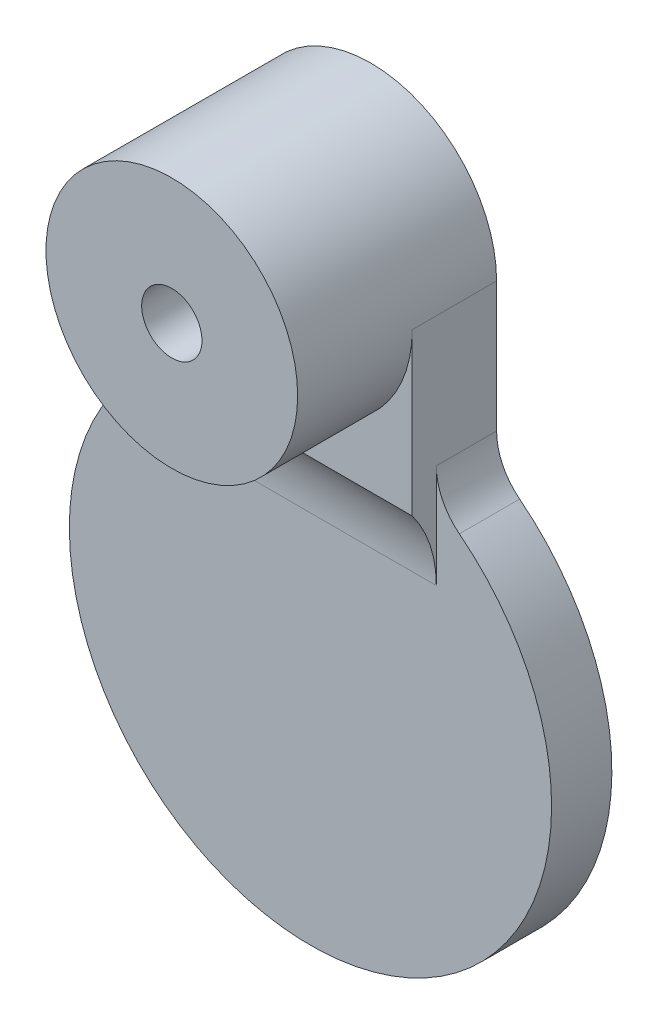
ISO-10303-21;
HEADER;
FILE_DESCRIPTION(('STEP AP214'),'2;1');
FILE_NAME('part.step','',(''),(''),'','','');
FILE_SCHEMA(('AUTOMOTIVE_DESIGN { 1 0 10303 214 1 1 1 1 }'));
ENDSEC;
DATA;
#1=APPLICATION_CONTEXT('core data for automotive mechanical design processes');
#2=APPLICATION_PROTOCOL_DEFINITION('international standard','automotive_design',2000,#1);
#3=PRODUCT_CONTEXT('',#1,'mechanical');
#4=PRODUCT('Part','Part','',(#3));
#5=PRODUCT_RELATED_PRODUCT_CATEGORY('part','',(#4));
#6=PRODUCT_DEFINITION_FORMATION('','',#4);
#7=PRODUCT_DEFINITION_CONTEXT('part definition',#1,'design');
#8=PRODUCT_DEFINITION('design','',#6,#7);
#9=PRODUCT_DEFINITION_SHAPE('','',#8);
#10=(LENGTH_UNIT() NAMED_UNIT(*) SI_UNIT(.MILLI.,.METRE.));
#11=(NAMED_UNIT(*) PLANE_ANGLE_UNIT() SI_UNIT($,.RADIAN.));
#12=(NAMED_UNIT(*) SI_UNIT($,.STERADIAN.) SOLID_ANGLE_UNIT());
#13=UNCERTAINTY_MEASURE_WITH_UNIT(LENGTH_MEASURE(1.E-05),#10,'distance_accuracy_value','');
#14=(GEOMETRIC_REPRESENTATION_CONTEXT(3) GLOBAL_UNCERTAINTY_ASSIGNED_CONTEXT((#13)) GLOBAL_UNIT_ASSIGNED_CONTEXT((#10,
#11,#12)) REPRESENTATION_CONTEXT('',''));
#15=CARTESIAN_POINT('',(0.,0.,0.));
#16=DIRECTION('',(0.,0.,1.));
#17=DIRECTION('',(1.,0.,0.));
#18=AXIS2_PLACEMENT_3D('',#15,#16,#17);
#19=CARTESIAN_POINT('',(0.,0.,2.54));
#20=DIRECTION('',(0.,0.,-1.));
#21=DIRECTION('',(-1.,0.,0.));
#22=AXIS2_PLACEMENT_3D('',#19,#20,#21);
#23=CYLINDRICAL_SURFACE('',#22,10.16);
#24=CARTESIAN_POINT('',(0.,0.,2.54));
#25=DIRECTION('',(0.,0.,1.));
#26=DIRECTION('',(1.,0.,0.));
#27=AXIS2_PLACEMENT_3D('',#24,#25,#26);
#28=CIRCLE('',#27,10.16);
#29=CARTESIAN_POINT('',(-6.2743940608368,7.99109374049235,2.54));
#30=VERTEX_POINT('',#29);
#31=CARTESIAN_POINT('',(6.2743940608368,7.99109374049235,2.54));
#32=VERTEX_POINT('',#31);
#33=EDGE_CURVE('E138',#30,#32,#28,.T.);
#34=ORIENTED_EDGE('',*,*,#33,.F.);
#35=DIRECTION('',(0.,0.,-1.));
#36=VECTOR('',#35,1.);
#37=CARTESIAN_POINT('',(-6.2743940608368,7.99109374049235,2.54));
#38=LINE('',#37,#36);
#39=CARTESIAN_POINT('',(-6.2743940608368,7.99109374049235,0.));
#40=VERTEX_POINT('',#39);
#41=EDGE_CURVE('E145',#30,#40,#38,.T.);
#42=ORIENTED_EDGE('',*,*,#41,.T.);
#43=CARTESIAN_POINT('',(0.,0.,0.));
#44=DIRECTION('',(0.,0.,1.));
#45=DIRECTION('',(1.,0.,0.));
#46=AXIS2_PLACEMENT_3D('',#43,#44,#45);
#47=CIRCLE('',#46,10.16);
#48=CARTESIAN_POINT('',(6.2743940608368,7.99109374049235,0.));
#49=VERTEX_POINT('',#48);
#50=EDGE_CURVE('E137',#40,#49,#47,.T.);
#51=ORIENTED_EDGE('',*,*,#50,.T.);
#52=DIRECTION('',(0.,0.,-1.));
#53=VECTOR('',#52,1.);
#54=CARTESIAN_POINT('',(6.2743940608368,7.99109374049235,2.54));
#55=LINE('',#54,#53);
#56=EDGE_CURVE('E141',#49,#32,#55,.F.);
#57=ORIENTED_EDGE('',*,*,#56,.T.);
#58=EDGE_LOOP('',(#34,#42,#51,#57));
#59=FACE_BOUND('',#58,.T.);
#60=ADVANCED_FACE('F35',(#59),#23,.T.);
#61=CARTESIAN_POINT('',(0.,0.,2.54));
#62=DIRECTION('',(0.,0.,1.));
#63=DIRECTION('',(1.,0.,0.));
#64=AXIS2_PLACEMENT_3D('',#61,#62,#63);
#65=PLANE('',#64);
#66=DIRECTION('',(0.,1.,0.));
#67=VECTOR('',#66,1.);
#68=CARTESIAN_POINT('',(5.30299257604599,0.,2.54));
#69=LINE('',#68,#67);
#70=CARTESIAN_POINT('',(5.30299257604599,5.61824888509447,2.54));
#71=VERTEX_POINT('',#70);
#72=CARTESIAN_POINT('',(5.30299257604599,9.98886717561543,2.54));
#73=VERTEX_POINT('',#72);
#74=EDGE_CURVE('E50',#71,#73,#69,.T.);
#75=ORIENTED_EDGE('',*,*,#74,.F.);
#76=DIRECTION('',(1.,0.,0.));
#77=VECTOR('',#76,1.);
#78=CARTESIAN_POINT('',(-5.30299257604599,5.61824888509447,2.54));
#79=LINE('',#78,#77);
#80=CARTESIAN_POINT('',(-5.30299257604599,5.61824888509447,2.54));
#81=VERTEX_POINT('',#80);
#82=EDGE_CURVE('E162',#71,#81,#79,.F.);
#83=ORIENTED_EDGE('',*,*,#82,.T.);
#84=DIRECTION('',(0.,-1.,0.));
#85=VECTOR('',#84,1.);
#86=CARTESIAN_POINT('',(-5.30299257604599,0.,2.54));
#87=LINE('',#86,#85);
#88=CARTESIAN_POINT('',(-5.30299257604599,9.98886717561543,2.54));
#89=VERTEX_POINT('',#88);
#90=EDGE_CURVE('E57',#89,#81,#87,.T.);
#91=ORIENTED_EDGE('',*,*,#90,.F.);
#92=CARTESIAN_POINT('',(-7.84299257604599,9.98886717561543,2.54));
#93=DIRECTION('',(0.,0.,1.));
#94=DIRECTION('',(1.,0.,0.));
#95=AXIS2_PLACEMENT_3D('',#92,#93,#94);
#96=CIRCLE('',#95,2.54);
#97=EDGE_CURVE('E156',#89,#30,#96,.F.);
#98=ORIENTED_EDGE('',*,*,#97,.T.);
#99=ORIENTED_EDGE('',*,*,#33,.T.);
#100=CARTESIAN_POINT('',(7.84299257604599,9.98886717561543,2.54));
#101=DIRECTION('',(0.,0.,1.));
#102=DIRECTION('',(1.,0.,0.));
#103=AXIS2_PLACEMENT_3D('',#100,#101,#102);
#104=CIRCLE('',#103,2.54);
#105=EDGE_CURVE('E160',#32,#73,#104,.F.);
#106=ORIENTED_EDGE('',*,*,#105,.T.);
#107=EDGE_LOOP('',(#75,#83,#91,#98,#99,#106));
#108=FACE_BOUND('',#107,.T.);
#109=ADVANCED_FACE('F167',(#108),#65,.T.);
#110=CARTESIAN_POINT('',(0.,0.,0.));
#111=DIRECTION('',(0.,0.,1.));
#112=DIRECTION('',(1.,0.,0.));
#113=AXIS2_PLACEMENT_3D('',#110,#111,#112);
#114=PLANE('',#113);
#115=ORIENTED_EDGE('',*,*,#50,.F.);
#116=CARTESIAN_POINT('',(-7.84299257604599,9.98886717561543,0.));
#117=DIRECTION('',(0.,0.,1.));
#118=DIRECTION('',(1.,0.,0.));
#119=AXIS2_PLACEMENT_3D('',#116,#117,#118);
#120=CIRCLE('',#119,2.54);
#121=CARTESIAN_POINT('',(-5.30299257604599,9.98886717561543,0.));
#122=VERTEX_POINT('',#121);
#123=EDGE_CURVE('E154',#40,#122,#120,.T.);
#124=ORIENTED_EDGE('',*,*,#123,.T.);
#125=DIRECTION('',(0.,-1.,0.));
#126=VECTOR('',#125,1.);
#127=CARTESIAN_POINT('',(-5.30299257604599,0.,0.));
#128=LINE('',#127,#126);
#129=CARTESIAN_POINT('',(-5.30299257604599,15.462992576046,0.));
#130=VERTEX_POINT('',#129);
#131=EDGE_CURVE('E126',#130,#122,#128,.T.);
#132=ORIENTED_EDGE('',*,*,#131,.F.);
#133=CARTESIAN_POINT('',(0.,15.462992576046,0.));
#134=DIRECTION('',(0.,0.,1.));
#135=DIRECTION('',(1.,0.,0.));
#136=AXIS2_PLACEMENT_3D('',#133,#134,#135);
#137=CIRCLE('',#136,5.30299257604599);
#138=CARTESIAN_POINT('',(5.30299257604599,15.462992576046,0.));
#139=VERTEX_POINT('',#138);
#140=EDGE_CURVE('E129',#139,#130,#137,.T.);
#141=ORIENTED_EDGE('',*,*,#140,.F.);
#142=DIRECTION('',(0.,-1.,0.));
#143=VECTOR('',#142,1.);
#144=CARTESIAN_POINT('',(5.30299257604599,0.,0.));
#145=LINE('',#144,#143);
#146=CARTESIAN_POINT('',(5.30299257604599,9.98886717561543,0.));
#147=VERTEX_POINT('',#146);
#148=EDGE_CURVE('E116',#139,#147,#145,.T.);
#149=ORIENTED_EDGE('',*,*,#148,.T.);
#150=CARTESIAN_POINT('',(7.84299257604599,9.98886717561543,0.));
#151=DIRECTION('',(0.,0.,1.));
#152=DIRECTION('',(1.,0.,0.));
#153=AXIS2_PLACEMENT_3D('',#150,#151,#152);
#154=CIRCLE('',#153,2.54);
#155=EDGE_CURVE('E158',#147,#49,#154,.T.);
#156=ORIENTED_EDGE('',*,*,#155,.T.);
#157=EDGE_LOOP('',(#115,#124,#132,#141,#149,#156));
#158=FACE_BOUND('',#157,.T.);
#159=CARTESIAN_POINT('',(0.,15.462992576046,0.));
#160=DIRECTION('',(0.,0.,1.));
#161=DIRECTION('',(1.,0.,0.));
#162=AXIS2_PLACEMENT_3D('',#159,#160,#161);
#163=CIRCLE('',#162,1.27);
#164=CARTESIAN_POINT('',(1.27,15.462992576046,0.));
#165=VERTEX_POINT('',#164);
#166=EDGE_CURVE('E226',#165,#165,#163,.T.);
#167=ORIENTED_EDGE('',*,*,#166,.T.);
#168=EDGE_LOOP('',(#167));
#169=FACE_BOUND('',#168,.T.);
#170=ADVANCED_FACE('F180',(#158,#169),#114,.F.);
#171=CARTESIAN_POINT('',(-5.30299257604599,0.,3.556));
#172=DIRECTION('',(1.,0.,0.));
#173=DIRECTION('',(0.,0.,-1.));
#174=AXIS2_PLACEMENT_3D('',#171,#172,#173);
#175=PLANE('',#174);
#176=ORIENTED_EDGE('',*,*,#131,.T.);
#177=DIRECTION('',(0.,0.,1.));
#178=VECTOR('',#177,1.);
#179=CARTESIAN_POINT('',(-5.30299257604599,9.98886717561543,2.54));
#180=LINE('',#179,#178);
#181=EDGE_CURVE('E149',#122,#89,#180,.T.);
#182=ORIENTED_EDGE('',*,*,#181,.T.);
#183=ORIENTED_EDGE('',*,*,#90,.T.);
#184=CARTESIAN_POINT('',(-5.30299257604599,5.61824888509447,7.62));
#185=DIRECTION('',(1.,0.,0.));
#186=DIRECTION('',(0.,0.,-1.));
#187=AXIS2_PLACEMENT_3D('',#184,#185,#186);
#188=CIRCLE('',#187,5.08);
#189=CARTESIAN_POINT('',(-5.30299257604599,8.66624888509447,3.556));
#190=VERTEX_POINT('',#189);
#191=EDGE_CURVE('E11',#81,#190,#188,.T.);
#192=ORIENTED_EDGE('',*,*,#191,.T.);
#193=DIRECTION('',(0.,-1.,0.));
#194=VECTOR('',#193,1.);
#195=CARTESIAN_POINT('',(-5.30299257604599,0.,3.556));
#196=LINE('',#195,#194);
#197=CARTESIAN_POINT('',(-5.30299257604599,15.462992576046,3.556));
#198=VERTEX_POINT('',#197);
#199=EDGE_CURVE('E123',#198,#190,#196,.T.);
#200=ORIENTED_EDGE('',*,*,#199,.F.);
#201=DIRECTION('',(0.,0.,-1.));
#202=VECTOR('',#201,1.);
#203=CARTESIAN_POINT('',(-5.30299257604599,15.462992576046,3.556));
#204=LINE('',#203,#202);
#205=EDGE_CURVE('E120',#198,#130,#204,.T.);
#206=ORIENTED_EDGE('',*,*,#205,.T.);
#207=EDGE_LOOP('',(#176,#182,#183,#192,#200,#206));
#208=FACE_BOUND('',#207,.T.);
#209=ADVANCED_FACE('F171',(#208),#175,.F.);
#210=CARTESIAN_POINT('',(5.30299257604599,0.,3.556));
#211=DIRECTION('',(1.,0.,0.));
#212=DIRECTION('',(0.,0.,-1.));
#213=AXIS2_PLACEMENT_3D('',#210,#211,#212);
#214=PLANE('',#213);
#215=ORIENTED_EDGE('',*,*,#74,.T.);
#216=DIRECTION('',(0.,0.,-1.));
#217=VECTOR('',#216,1.);
#218=CARTESIAN_POINT('',(5.30299257604599,9.98886717561543,3.556));
#219=LINE('',#218,#217);
#220=EDGE_CURVE('E152',#73,#147,#219,.T.);
#221=ORIENTED_EDGE('',*,*,#220,.T.);
#222=ORIENTED_EDGE('',*,*,#148,.F.);
#223=DIRECTION('',(0.,0.,-1.));
#224=VECTOR('',#223,1.);
#225=CARTESIAN_POINT('',(5.30299257604599,15.462992576046,3.556));
#226=LINE('',#225,#224);
#227=CARTESIAN_POINT('',(5.30299257604599,15.462992576046,3.556));
#228=VERTEX_POINT('',#227);
#229=EDGE_CURVE('E110',#228,#139,#226,.T.);
#230=ORIENTED_EDGE('',*,*,#229,.F.);
#231=DIRECTION('',(0.,-1.,0.));
#232=VECTOR('',#231,1.);
#233=CARTESIAN_POINT('',(5.30299257604599,0.,3.556));
#234=LINE('',#233,#232);
#235=CARTESIAN_POINT('',(5.30299257604599,8.66624888509447,3.556));
#236=VERTEX_POINT('',#235);
#237=EDGE_CURVE('E100',#228,#236,#234,.T.);
#238=ORIENTED_EDGE('',*,*,#237,.T.);
#239=CARTESIAN_POINT('',(5.30299257604599,5.61824888509447,7.62));
#240=DIRECTION('',(1.,0.,0.));
#241=DIRECTION('',(0.,0.,-1.));
#242=AXIS2_PLACEMENT_3D('',#239,#240,#241);
#243=CIRCLE('',#242,5.08);
#244=EDGE_CURVE('E43',#236,#71,#243,.F.);
#245=ORIENTED_EDGE('',*,*,#244,.T.);
#246=EDGE_LOOP('',(#215,#221,#222,#230,#238,#245));
#247=FACE_BOUND('',#246,.T.);
#248=ADVANCED_FACE('F113',(#247),#214,.T.);
#249=CARTESIAN_POINT('',(0.,0.,3.556));
#250=DIRECTION('',(0.,0.,1.));
#251=DIRECTION('',(1.,0.,0.));
#252=AXIS2_PLACEMENT_3D('',#249,#250,#251);
#253=PLANE('',#252);
#254=CARTESIAN_POINT('',(0.,15.462992576046,3.556));
#255=DIRECTION('',(0.,0.,1.));
#256=DIRECTION('',(1.,0.,0.));
#257=AXIS2_PLACEMENT_3D('',#254,#255,#256);
#258=CIRCLE('',#257,5.30299257604599);
#259=EDGE_CURVE('E105',#198,#228,#258,.T.);
#260=ORIENTED_EDGE('',*,*,#259,.F.);
#261=ORIENTED_EDGE('',*,*,#199,.T.);
#262=DIRECTION('',(-1.,0.,0.));
#263=VECTOR('',#262,1.);
#264=CARTESIAN_POINT('',(0.,8.66624888509447,3.556));
#265=LINE('',#264,#263);
#266=EDGE_CURVE('E108',#236,#190,#265,.T.);
#267=ORIENTED_EDGE('',*,*,#266,.F.);
#268=ORIENTED_EDGE('',*,*,#237,.F.);
#269=EDGE_LOOP('',(#260,#261,#267,#268));
#270=FACE_BOUND('',#269,.T.);
#271=ADVANCED_FACE('F102',(#270),#253,.T.);
#272=CARTESIAN_POINT('',(0.,15.462992576046,8.382));
#273=DIRECTION('',(0.,0.,-1.));
#274=DIRECTION('',(-1.,0.,0.));
#275=AXIS2_PLACEMENT_3D('',#272,#273,#274);
#276=CYLINDRICAL_SURFACE('',#275,5.30299257604599);
#277=CARTESIAN_POINT('',(0.,15.462992576046,8.382));
#278=DIRECTION('',(0.,0.,1.));
#279=DIRECTION('',(1.,0.,0.));
#280=AXIS2_PLACEMENT_3D('',#277,#278,#279);
#281=CIRCLE('',#280,5.30299257604599);
#282=CARTESIAN_POINT('',(5.30299257604599,15.462992576046,8.382));
#283=VERTEX_POINT('',#282);
#284=EDGE_CURVE('E134',#283,#283,#281,.T.);
#285=ORIENTED_EDGE('',*,*,#284,.F.);
#286=EDGE_LOOP('',(#285));
#287=FACE_BOUND('',#286,.T.);
#288=ORIENTED_EDGE('',*,*,#140,.T.);
#289=ORIENTED_EDGE('',*,*,#205,.F.);
#290=ORIENTED_EDGE('',*,*,#259,.T.);
#291=ORIENTED_EDGE('',*,*,#229,.T.);
#292=EDGE_LOOP('',(#288,#289,#290,#291));
#293=FACE_BOUND('',#292,.T.);
#294=ADVANCED_FACE('F122',(#287,#293),#276,.T.);
#295=CARTESIAN_POINT('',(0.,15.462992576046,8.382));
#296=DIRECTION('',(0.,0.,-1.));
#297=DIRECTION('',(-1.,0.,0.));
#298=AXIS2_PLACEMENT_3D('',#295,#296,#297);
#299=CYLINDRICAL_SURFACE('',#298,1.27);
#300=CARTESIAN_POINT('',(0.,15.462992576046,8.382));
#301=DIRECTION('',(0.,0.,1.));
#302=DIRECTION('',(1.,0.,0.));
#303=AXIS2_PLACEMENT_3D('',#300,#301,#302);
#304=CIRCLE('',#303,1.27);
#305=CARTESIAN_POINT('',(1.27,15.462992576046,8.382));
#306=VERTEX_POINT('',#305);
#307=EDGE_CURVE('E221',#306,#306,#304,.T.);
#308=ORIENTED_EDGE('',*,*,#307,.T.);
#309=EDGE_LOOP('',(#308));
#310=FACE_BOUND('',#309,.T.);
#311=ORIENTED_EDGE('',*,*,#166,.F.);
#312=EDGE_LOOP('',(#311));
#313=FACE_BOUND('',#312,.T.);
#314=ADVANCED_FACE('F207',(#310,#313),#299,.F.);
#315=CARTESIAN_POINT('',(0.,0.,8.382));
#316=DIRECTION('',(0.,0.,1.));
#317=DIRECTION('',(1.,0.,0.));
#318=AXIS2_PLACEMENT_3D('',#315,#316,#317);
#319=PLANE('',#318);
#320=ORIENTED_EDGE('',*,*,#307,.F.);
#321=EDGE_LOOP('',(#320));
#322=FACE_BOUND('',#321,.T.);
#323=ORIENTED_EDGE('',*,*,#284,.T.);
#324=EDGE_LOOP('',(#323));
#325=FACE_BOUND('',#324,.T.);
#326=ADVANCED_FACE('F190',(#322,#325),#319,.T.);
#327=CARTESIAN_POINT('',(-7.84299257604599,9.98886717561543,2.54));
#328=DIRECTION('',(0.,0.,-1.));
#329=DIRECTION('',(-1.,0.,0.));
#330=AXIS2_PLACEMENT_3D('',#327,#328,#329);
#331=CYLINDRICAL_SURFACE('',#330,2.54);
#332=ORIENTED_EDGE('',*,*,#97,.F.);
#333=ORIENTED_EDGE('',*,*,#181,.F.);
#334=ORIENTED_EDGE('',*,*,#123,.F.);
#335=ORIENTED_EDGE('',*,*,#41,.F.);
#336=EDGE_LOOP('',(#332,#333,#334,#335));
#337=FACE_BOUND('',#336,.T.);
#338=ADVANCED_FACE('F175',(#337),#331,.F.);
#339=CARTESIAN_POINT('',(7.84299257604599,9.98886717561543,2.54));
#340=DIRECTION('',(0.,0.,-1.));
#341=DIRECTION('',(-1.,0.,0.));
#342=AXIS2_PLACEMENT_3D('',#339,#340,#341);
#343=CYLINDRICAL_SURFACE('',#342,2.54);
#344=ORIENTED_EDGE('',*,*,#105,.F.);
#345=ORIENTED_EDGE('',*,*,#56,.F.);
#346=ORIENTED_EDGE('',*,*,#155,.F.);
#347=ORIENTED_EDGE('',*,*,#220,.F.);
#348=EDGE_LOOP('',(#344,#345,#346,#347));
#349=FACE_BOUND('',#348,.T.);
#350=ADVANCED_FACE('F184',(#349),#343,.F.);
#351=CARTESIAN_POINT('',(0.,5.61824888509447,7.62));
#352=DIRECTION('',(-1.,0.,0.));
#353=DIRECTION('',(0.,0.,1.));
#354=AXIS2_PLACEMENT_3D('',#351,#352,#353);
#355=CYLINDRICAL_SURFACE('',#354,5.08);
#356=ORIENTED_EDGE('',*,*,#191,.F.);
#357=ORIENTED_EDGE('',*,*,#82,.F.);
#358=ORIENTED_EDGE('',*,*,#244,.F.);
#359=ORIENTED_EDGE('',*,*,#266,.T.);
#360=EDGE_LOOP('',(#356,#357,#358,#359));
#361=FACE_BOUND('',#360,.T.);
#362=ADVANCED_FACE('F37',(#361),#355,.F.);
#363=CLOSED_SHELL('',(#60,#109,#170,#209,#248,#271,#294,#314,#326,#338,#350,#362));
#364=MANIFOLD_SOLID_BREP('B2',#363);
#365=ADVANCED_BREP_SHAPE_REPRESENTATION('',(#18,#364),#14);
#366=SHAPE_DEFINITION_REPRESENTATION(#9,#365);
ENDSEC;
END-ISO-10303-21;
